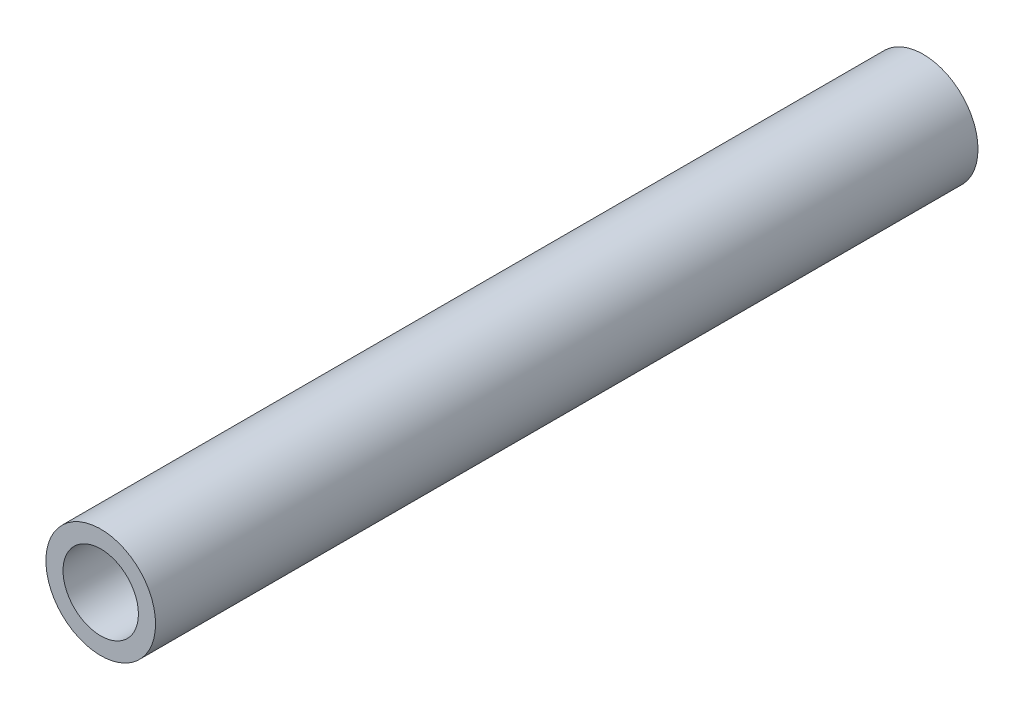
ISO-10303-21;
HEADER;
FILE_DESCRIPTION(('STEP AP214'),'2;1');
FILE_NAME('part.step','',(''),(''),'','','');
FILE_SCHEMA(('AUTOMOTIVE_DESIGN { 1 0 10303 214 1 1 1 1 }'));
ENDSEC;
DATA;
#1=APPLICATION_CONTEXT('core data for automotive mechanical design processes');
#2=APPLICATION_PROTOCOL_DEFINITION('international standard','automotive_design',2000,#1);
#3=PRODUCT_CONTEXT('',#1,'mechanical');
#4=PRODUCT('Part','Part','',(#3));
#5=PRODUCT_RELATED_PRODUCT_CATEGORY('part','',(#4));
#6=PRODUCT_DEFINITION_FORMATION('','',#4);
#7=PRODUCT_DEFINITION_CONTEXT('part definition',#1,'design');
#8=PRODUCT_DEFINITION('design','',#6,#7);
#9=PRODUCT_DEFINITION_SHAPE('','',#8);
#10=(LENGTH_UNIT() NAMED_UNIT(*) SI_UNIT(.MILLI.,.METRE.));
#11=(NAMED_UNIT(*) PLANE_ANGLE_UNIT() SI_UNIT($,.RADIAN.));
#12=(NAMED_UNIT(*) SI_UNIT($,.STERADIAN.) SOLID_ANGLE_UNIT());
#13=UNCERTAINTY_MEASURE_WITH_UNIT(LENGTH_MEASURE(1.E-05),#10,'distance_accuracy_value','');
#14=(GEOMETRIC_REPRESENTATION_CONTEXT(3) GLOBAL_UNCERTAINTY_ASSIGNED_CONTEXT((#13)) GLOBAL_UNIT_ASSIGNED_CONTEXT((#10,
#11,#12)) REPRESENTATION_CONTEXT('',''));
#15=CARTESIAN_POINT('',(0.,0.,0.));
#16=DIRECTION('',(0.,0.,1.));
#17=DIRECTION('',(1.,0.,0.));
#18=AXIS2_PLACEMENT_3D('',#15,#16,#17);
#19=CARTESIAN_POINT('',(0.,0.,190.5));
#20=DIRECTION('',(0.,0.,1.));
#21=DIRECTION('',(1.,0.,0.));
#22=AXIS2_PLACEMENT_3D('',#19,#20,#21);
#23=PLANE('',#22);
#24=CARTESIAN_POINT('',(0.,0.,190.5));
#25=DIRECTION('',(0.,0.,1.));
#26=DIRECTION('',(1.,0.,0.));
#27=AXIS2_PLACEMENT_3D('',#24,#25,#26);
#28=CIRCLE('',#27,12.7);
#29=CARTESIAN_POINT('',(12.7,0.,190.5));
#30=VERTEX_POINT('',#29);
#31=EDGE_CURVE('E12',#30,#30,#28,.T.);
#32=ORIENTED_EDGE('',*,*,#31,.T.);
#33=EDGE_LOOP('',(#32));
#34=FACE_BOUND('',#33,.T.);
#35=CARTESIAN_POINT('',(0.,0.,190.5));
#36=DIRECTION('',(0.,0.,1.));
#37=DIRECTION('',(1.,0.,0.));
#38=AXIS2_PLACEMENT_3D('',#35,#36,#37);
#39=CIRCLE('',#38,8.73125);
#40=CARTESIAN_POINT('',(8.73125,0.,190.5));
#41=VERTEX_POINT('',#40);
#42=EDGE_CURVE('E55',#41,#41,#39,.T.);
#43=ORIENTED_EDGE('',*,*,#42,.F.);
#44=EDGE_LOOP('',(#43));
#45=FACE_BOUND('',#44,.T.);
#46=ADVANCED_FACE('F44',(#34,#45),#23,.T.);
#47=CARTESIAN_POINT('',(0.,0.,0.));
#48=DIRECTION('',(0.,0.,1.));
#49=DIRECTION('',(1.,0.,0.));
#50=AXIS2_PLACEMENT_3D('',#47,#48,#49);
#51=PLANE('',#50);
#52=CARTESIAN_POINT('',(0.,0.,0.));
#53=DIRECTION('',(0.,0.,1.));
#54=DIRECTION('',(1.,0.,0.));
#55=AXIS2_PLACEMENT_3D('',#52,#53,#54);
#56=CIRCLE('',#55,12.7);
#57=CARTESIAN_POINT('',(12.7,0.,0.));
#58=VERTEX_POINT('',#57);
#59=EDGE_CURVE('E48',#58,#58,#56,.T.);
#60=ORIENTED_EDGE('',*,*,#59,.F.);
#61=EDGE_LOOP('',(#60));
#62=FACE_BOUND('',#61,.T.);
#63=CARTESIAN_POINT('',(0.,0.,0.));
#64=DIRECTION('',(0.,0.,1.));
#65=DIRECTION('',(1.,0.,0.));
#66=AXIS2_PLACEMENT_3D('',#63,#64,#65);
#67=CIRCLE('',#66,8.73125);
#68=CARTESIAN_POINT('',(8.73125,0.,0.));
#69=VERTEX_POINT('',#68);
#70=EDGE_CURVE('E57',#69,#69,#67,.T.);
#71=ORIENTED_EDGE('',*,*,#70,.T.);
#72=EDGE_LOOP('',(#71));
#73=FACE_BOUND('',#72,.T.);
#74=ADVANCED_FACE('F67',(#62,#73),#51,.F.);
#75=CARTESIAN_POINT('',(0.,0.,190.5));
#76=DIRECTION('',(0.,0.,-1.));
#77=DIRECTION('',(-1.,0.,0.));
#78=AXIS2_PLACEMENT_3D('',#75,#76,#77);
#79=CYLINDRICAL_SURFACE('',#78,12.7);
#80=ORIENTED_EDGE('',*,*,#31,.F.);
#81=EDGE_LOOP('',(#80));
#82=FACE_BOUND('',#81,.T.);
#83=ORIENTED_EDGE('',*,*,#59,.T.);
#84=EDGE_LOOP('',(#83));
#85=FACE_BOUND('',#84,.T.);
#86=ADVANCED_FACE('F46',(#82,#85),#79,.T.);
#87=CARTESIAN_POINT('',(0.,0.,190.5));
#88=DIRECTION('',(0.,0.,-1.));
#89=DIRECTION('',(-1.,0.,0.));
#90=AXIS2_PLACEMENT_3D('',#87,#88,#89);
#91=CYLINDRICAL_SURFACE('',#90,8.73125);
#92=ORIENTED_EDGE('',*,*,#42,.T.);
#93=EDGE_LOOP('',(#92));
#94=FACE_BOUND('',#93,.T.);
#95=ORIENTED_EDGE('',*,*,#70,.F.);
#96=EDGE_LOOP('',(#95));
#97=FACE_BOUND('',#96,.T.);
#98=ADVANCED_FACE('F63',(#94,#97),#91,.F.);
#99=CLOSED_SHELL('',(#46,#74,#86,#98));
#100=MANIFOLD_SOLID_BREP('B2',#99);
#101=ADVANCED_BREP_SHAPE_REPRESENTATION('',(#18,#100),#14);
#102=SHAPE_DEFINITION_REPRESENTATION(#9,#101);
ENDSEC;
END-ISO-10303-21;
